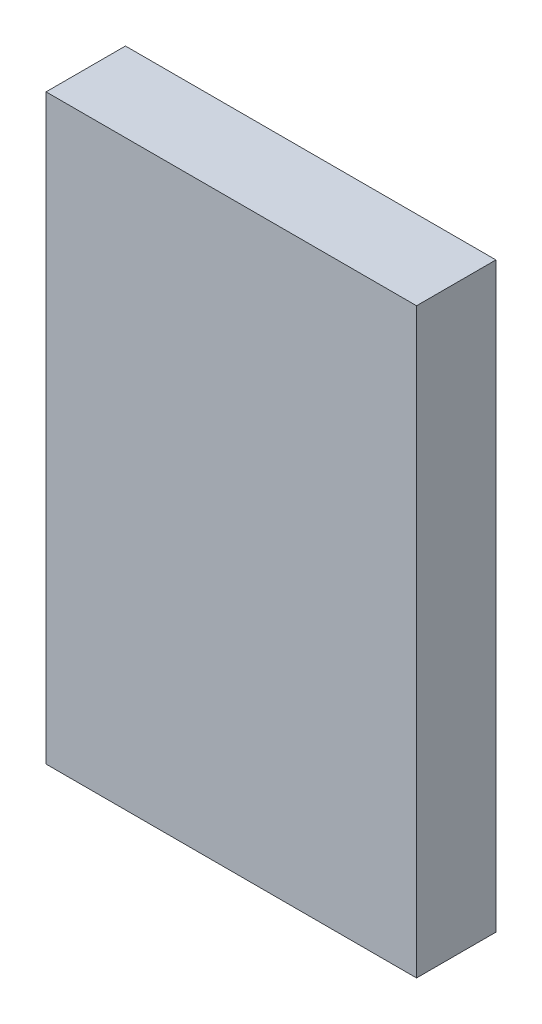
ISO-10303-21;
HEADER;
FILE_DESCRIPTION(('STEP AP214'),'2;1');
FILE_NAME('part.step','',(''),(''),'','','');
FILE_SCHEMA(('AUTOMOTIVE_DESIGN { 1 0 10303 214 1 1 1 1 }'));
ENDSEC;
DATA;
#1=APPLICATION_CONTEXT('core data for automotive mechanical design processes');
#2=APPLICATION_PROTOCOL_DEFINITION('international standard','automotive_design',2000,#1);
#3=PRODUCT_CONTEXT('',#1,'mechanical');
#4=PRODUCT('Part','Part','',(#3));
#5=PRODUCT_RELATED_PRODUCT_CATEGORY('part','',(#4));
#6=PRODUCT_DEFINITION_FORMATION('','',#4);
#7=PRODUCT_DEFINITION_CONTEXT('part definition',#1,'design');
#8=PRODUCT_DEFINITION('design','',#6,#7);
#9=PRODUCT_DEFINITION_SHAPE('','',#8);
#10=(LENGTH_UNIT() NAMED_UNIT(*) SI_UNIT(.MILLI.,.METRE.));
#11=(NAMED_UNIT(*) PLANE_ANGLE_UNIT() SI_UNIT($,.RADIAN.));
#12=(NAMED_UNIT(*) SI_UNIT($,.STERADIAN.) SOLID_ANGLE_UNIT());
#13=UNCERTAINTY_MEASURE_WITH_UNIT(LENGTH_MEASURE(1.E-05),#10,'distance_accuracy_value','');
#14=(GEOMETRIC_REPRESENTATION_CONTEXT(3) GLOBAL_UNCERTAINTY_ASSIGNED_CONTEXT((#13)) GLOBAL_UNIT_ASSIGNED_CONTEXT((#10,
#11,#12)) REPRESENTATION_CONTEXT('',''));
#15=CARTESIAN_POINT('',(0.,0.,0.));
#16=DIRECTION('',(0.,0.,1.));
#17=DIRECTION('',(1.,0.,0.));
#18=AXIS2_PLACEMENT_3D('',#15,#16,#17);
#19=CARTESIAN_POINT('',(-23.0820866757774,9.906,6.5));
#20=DIRECTION('',(1.,0.,0.));
#21=DIRECTION('',(0.,0.,-1.));
#22=AXIS2_PLACEMENT_3D('',#19,#20,#21);
#23=PLANE('',#22);
#24=DIRECTION('',(0.,-1.,0.));
#25=VECTOR('',#24,1.);
#26=CARTESIAN_POINT('',(-23.0820866757774,9.906,2.));
#27=LINE('',#26,#25);
#28=CARTESIAN_POINT('',(-23.0820866757774,42.906,2.));
#29=VERTEX_POINT('',#28);
#30=CARTESIAN_POINT('',(-23.0820866757774,9.906,2.));
#31=VERTEX_POINT('',#30);
#32=EDGE_CURVE('E96',#29,#31,#27,.T.);
#33=ORIENTED_EDGE('',*,*,#32,.T.);
#34=DIRECTION('',(0.,0.,-1.));
#35=VECTOR('',#34,1.);
#36=CARTESIAN_POINT('',(-23.0820866757774,9.906,6.5));
#37=LINE('',#36,#35);
#38=CARTESIAN_POINT('',(-23.0820866757774,9.906,6.5));
#39=VERTEX_POINT('',#38);
#40=EDGE_CURVE('E11',#39,#31,#37,.T.);
#41=ORIENTED_EDGE('',*,*,#40,.F.);
#42=DIRECTION('',(0.,-1.,0.));
#43=VECTOR('',#42,1.);
#44=CARTESIAN_POINT('',(-23.0820866757774,9.906,6.5));
#45=LINE('',#44,#43);
#46=CARTESIAN_POINT('',(-23.0820866757774,42.906,6.5));
#47=VERTEX_POINT('',#46);
#48=EDGE_CURVE('E84',#47,#39,#45,.T.);
#49=ORIENTED_EDGE('',*,*,#48,.F.);
#50=DIRECTION('',(0.,0.,-1.));
#51=VECTOR('',#50,1.);
#52=CARTESIAN_POINT('',(-23.0820866757774,42.906,6.5));
#53=LINE('',#52,#51);
#54=EDGE_CURVE('E92',#47,#29,#53,.T.);
#55=ORIENTED_EDGE('',*,*,#54,.T.);
#56=EDGE_LOOP('',(#33,#41,#49,#55));
#57=FACE_BOUND('',#56,.T.);
#58=ADVANCED_FACE('F33',(#57),#23,.F.);
#59=CARTESIAN_POINT('',(-23.0820866757774,9.906,6.5));
#60=DIRECTION('',(0.,1.,0.));
#61=DIRECTION('',(0.,0.,1.));
#62=AXIS2_PLACEMENT_3D('',#59,#60,#61);
#63=PLANE('',#62);
#64=DIRECTION('',(1.,0.,0.));
#65=VECTOR('',#64,1.);
#66=CARTESIAN_POINT('',(-23.0820866757774,9.906,2.));
#67=LINE('',#66,#65);
#68=CARTESIAN_POINT('',(-2.08208667577742,9.906,2.));
#69=VERTEX_POINT('',#68);
#70=EDGE_CURVE('E88',#31,#69,#67,.T.);
#71=ORIENTED_EDGE('',*,*,#70,.T.);
#72=DIRECTION('',(0.,0.,-1.));
#73=VECTOR('',#72,1.);
#74=CARTESIAN_POINT('',(-2.08208667577742,9.906,6.5));
#75=LINE('',#74,#73);
#76=CARTESIAN_POINT('',(-2.08208667577742,9.906,6.5));
#77=VERTEX_POINT('',#76);
#78=EDGE_CURVE('E41',#77,#69,#75,.T.);
#79=ORIENTED_EDGE('',*,*,#78,.F.);
#80=DIRECTION('',(1.,0.,0.));
#81=VECTOR('',#80,1.);
#82=CARTESIAN_POINT('',(-23.0820866757774,9.906,6.5));
#83=LINE('',#82,#81);
#84=EDGE_CURVE('E79',#39,#77,#83,.T.);
#85=ORIENTED_EDGE('',*,*,#84,.F.);
#86=ORIENTED_EDGE('',*,*,#40,.T.);
#87=EDGE_LOOP('',(#71,#79,#85,#86));
#88=FACE_BOUND('',#87,.T.);
#89=ADVANCED_FACE('F87',(#88),#63,.F.);
#90=CARTESIAN_POINT('',(-2.08208667577742,9.906,6.5));
#91=DIRECTION('',(-1.,0.,0.));
#92=DIRECTION('',(0.,0.,1.));
#93=AXIS2_PLACEMENT_3D('',#90,#91,#92);
#94=PLANE('',#93);
#95=DIRECTION('',(0.,1.,0.));
#96=VECTOR('',#95,1.);
#97=CARTESIAN_POINT('',(-2.08208667577742,9.906,2.));
#98=LINE('',#97,#96);
#99=CARTESIAN_POINT('',(-2.08208667577742,42.906,2.));
#100=VERTEX_POINT('',#99);
#101=EDGE_CURVE('E66',#69,#100,#98,.T.);
#102=ORIENTED_EDGE('',*,*,#101,.T.);
#103=DIRECTION('',(0.,0.,-1.));
#104=VECTOR('',#103,1.);
#105=CARTESIAN_POINT('',(-2.08208667577742,42.906,6.5));
#106=LINE('',#105,#104);
#107=CARTESIAN_POINT('',(-2.08208667577742,42.906,6.5));
#108=VERTEX_POINT('',#107);
#109=EDGE_CURVE('E89',#108,#100,#106,.T.);
#110=ORIENTED_EDGE('',*,*,#109,.F.);
#111=DIRECTION('',(0.,1.,0.));
#112=VECTOR('',#111,1.);
#113=CARTESIAN_POINT('',(-2.08208667577742,9.906,6.5));
#114=LINE('',#113,#112);
#115=EDGE_CURVE('E82',#77,#108,#114,.T.);
#116=ORIENTED_EDGE('',*,*,#115,.F.);
#117=ORIENTED_EDGE('',*,*,#78,.T.);
#118=EDGE_LOOP('',(#102,#110,#116,#117));
#119=FACE_BOUND('',#118,.T.);
#120=ADVANCED_FACE('F90',(#119),#94,.F.);
#121=CARTESIAN_POINT('',(-23.0820866757774,42.906,6.5));
#122=DIRECTION('',(0.,-1.,0.));
#123=DIRECTION('',(0.,0.,-1.));
#124=AXIS2_PLACEMENT_3D('',#121,#122,#123);
#125=PLANE('',#124);
#126=DIRECTION('',(-1.,0.,0.));
#127=VECTOR('',#126,1.);
#128=CARTESIAN_POINT('',(-23.0820866757774,42.906,2.));
#129=LINE('',#128,#127);
#130=EDGE_CURVE('E72',#100,#29,#129,.T.);
#131=ORIENTED_EDGE('',*,*,#130,.T.);
#132=ORIENTED_EDGE('',*,*,#54,.F.);
#133=DIRECTION('',(-1.,0.,0.));
#134=VECTOR('',#133,1.);
#135=CARTESIAN_POINT('',(-23.0820866757774,42.906,6.5));
#136=LINE('',#135,#134);
#137=EDGE_CURVE('E49',#108,#47,#136,.T.);
#138=ORIENTED_EDGE('',*,*,#137,.F.);
#139=ORIENTED_EDGE('',*,*,#109,.T.);
#140=EDGE_LOOP('',(#131,#132,#138,#139));
#141=FACE_BOUND('',#140,.T.);
#142=ADVANCED_FACE('F103',(#141),#125,.F.);
#143=CARTESIAN_POINT('',(0.,0.,6.5));
#144=DIRECTION('',(0.,0.,-1.));
#145=DIRECTION('',(-1.,0.,0.));
#146=AXIS2_PLACEMENT_3D('',#143,#144,#145);
#147=PLANE('',#146);
#148=ORIENTED_EDGE('',*,*,#48,.T.);
#149=ORIENTED_EDGE('',*,*,#84,.T.);
#150=ORIENTED_EDGE('',*,*,#115,.T.);
#151=ORIENTED_EDGE('',*,*,#137,.T.);
#152=EDGE_LOOP('',(#148,#149,#150,#151));
#153=FACE_BOUND('',#152,.T.);
#154=ADVANCED_FACE('F80',(#153),#147,.F.);
#155=CARTESIAN_POINT('',(0.,0.,2.));
#156=DIRECTION('',(0.,0.,-1.));
#157=DIRECTION('',(-1.,0.,0.));
#158=AXIS2_PLACEMENT_3D('',#155,#156,#157);
#159=PLANE('',#158);
#160=ORIENTED_EDGE('',*,*,#32,.F.);
#161=ORIENTED_EDGE('',*,*,#130,.F.);
#162=ORIENTED_EDGE('',*,*,#101,.F.);
#163=ORIENTED_EDGE('',*,*,#70,.F.);
#164=EDGE_LOOP('',(#160,#161,#162,#163));
#165=FACE_BOUND('',#164,.T.);
#166=ADVANCED_FACE('F106',(#165),#159,.T.);
#167=CLOSED_SHELL('',(#58,#89,#120,#142,#154,#166));
#168=MANIFOLD_SOLID_BREP('B2',#167);
#169=ADVANCED_BREP_SHAPE_REPRESENTATION('',(#18,#168),#14);
#170=SHAPE_DEFINITION_REPRESENTATION(#9,#169);
ENDSEC;
END-ISO-10303-21;
